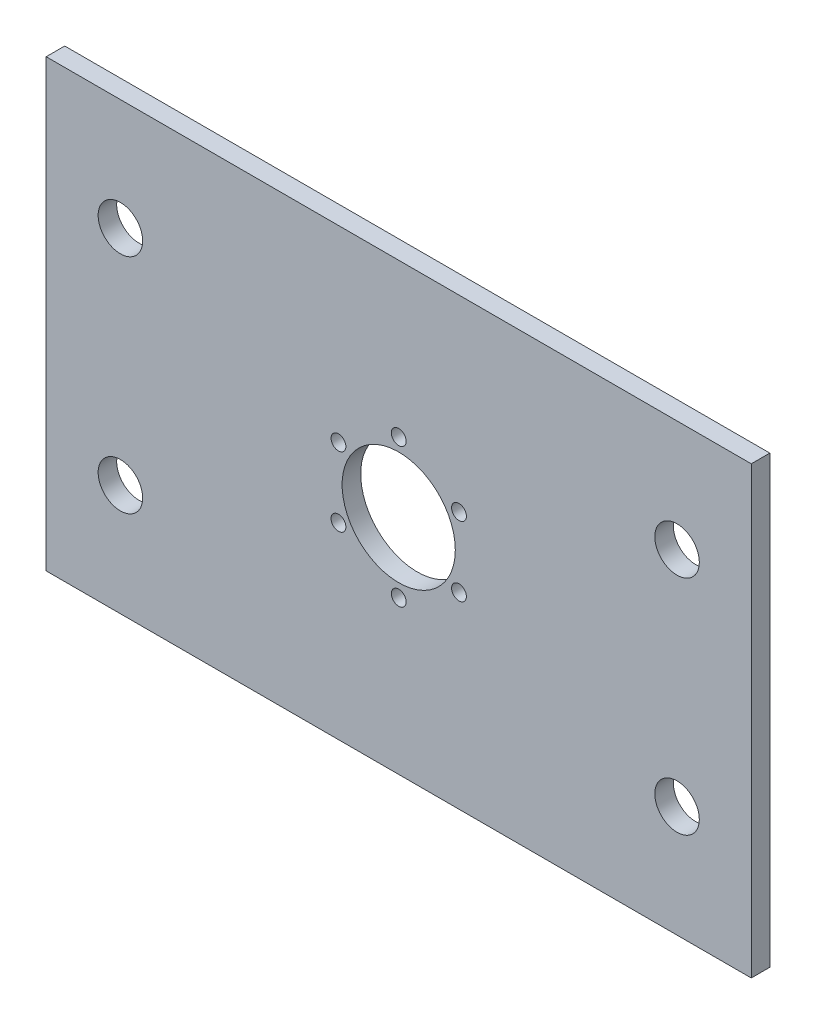
ISO-10303-21;
HEADER;
FILE_DESCRIPTION(('STEP AP214'),'2;1');
FILE_NAME('part.step','',(''),(''),'','','');
FILE_SCHEMA(('AUTOMOTIVE_DESIGN { 1 0 10303 214 1 1 1 1 }'));
ENDSEC;
DATA;
#1=APPLICATION_CONTEXT('core data for automotive mechanical design processes');
#2=APPLICATION_PROTOCOL_DEFINITION('international standard','automotive_design',2000,#1);
#3=PRODUCT_CONTEXT('',#1,'mechanical');
#4=PRODUCT('Part','Part','',(#3));
#5=PRODUCT_RELATED_PRODUCT_CATEGORY('part','',(#4));
#6=PRODUCT_DEFINITION_FORMATION('','',#4);
#7=PRODUCT_DEFINITION_CONTEXT('part definition',#1,'design');
#8=PRODUCT_DEFINITION('design','',#6,#7);
#9=PRODUCT_DEFINITION_SHAPE('','',#8);
#10=(LENGTH_UNIT() NAMED_UNIT(*) SI_UNIT(.MILLI.,.METRE.));
#11=(NAMED_UNIT(*) PLANE_ANGLE_UNIT() SI_UNIT($,.RADIAN.));
#12=(NAMED_UNIT(*) SI_UNIT($,.STERADIAN.) SOLID_ANGLE_UNIT());
#13=UNCERTAINTY_MEASURE_WITH_UNIT(LENGTH_MEASURE(1.E-05),#10,'distance_accuracy_value','');
#14=(GEOMETRIC_REPRESENTATION_CONTEXT(3) GLOBAL_UNCERTAINTY_ASSIGNED_CONTEXT((#13)) GLOBAL_UNIT_ASSIGNED_CONTEXT((#10,
#11,#12)) REPRESENTATION_CONTEXT('',''));
#15=CARTESIAN_POINT('',(0.,0.,0.));
#16=DIRECTION('',(0.,0.,1.));
#17=DIRECTION('',(1.,0.,0.));
#18=AXIS2_PLACEMENT_3D('',#15,#16,#17);
#19=CARTESIAN_POINT('',(0.,0.,5.));
#20=DIRECTION('',(0.,0.,1.));
#21=DIRECTION('',(1.,0.,0.));
#22=AXIS2_PLACEMENT_3D('',#19,#20,#21);
#23=PLANE('',#22);
#24=CARTESIAN_POINT('',(-16.2379763209583,-9.37499999999985,5.));
#25=DIRECTION('',(0.,0.,1.));
#26=DIRECTION('',(1.,0.,0.));
#27=AXIS2_PLACEMENT_3D('',#24,#25,#26);
#28=CIRCLE('',#27,2.);
#29=CARTESIAN_POINT('',(-14.2379763209583,-9.37499999999985,5.));
#30=VERTEX_POINT('',#29);
#31=EDGE_CURVE('E198',#30,#30,#28,.T.);
#32=ORIENTED_EDGE('',*,*,#31,.F.);
#33=EDGE_LOOP('',(#32));
#34=FACE_BOUND('',#33,.T.);
#35=CARTESIAN_POINT('',(16.2379763209582,-9.37500000000008,5.));
#36=DIRECTION('',(0.,0.,1.));
#37=DIRECTION('',(1.,0.,0.));
#38=AXIS2_PLACEMENT_3D('',#35,#36,#37);
#39=CIRCLE('',#38,2.);
#40=CARTESIAN_POINT('',(18.2379763209582,-9.37500000000008,5.));
#41=VERTEX_POINT('',#40);
#42=EDGE_CURVE('E182',#41,#41,#39,.T.);
#43=ORIENTED_EDGE('',*,*,#42,.F.);
#44=EDGE_LOOP('',(#43));
#45=FACE_BOUND('',#44,.T.);
#46=CARTESIAN_POINT('',(0.,18.75,5.));
#47=DIRECTION('',(0.,0.,1.));
#48=DIRECTION('',(1.,0.,0.));
#49=AXIS2_PLACEMENT_3D('',#46,#47,#48);
#50=CIRCLE('',#49,2.);
#51=CARTESIAN_POINT('',(2.,18.75,5.));
#52=VERTEX_POINT('',#51);
#53=EDGE_CURVE('E166',#52,#52,#50,.T.);
#54=ORIENTED_EDGE('',*,*,#53,.F.);
#55=EDGE_LOOP('',(#54));
#56=FACE_BOUND('',#55,.T.);
#57=CARTESIAN_POINT('',(-75.,-30.,5.));
#58=DIRECTION('',(0.,0.,1.));
#59=DIRECTION('',(1.,0.,0.));
#60=AXIS2_PLACEMENT_3D('',#57,#58,#59);
#61=CIRCLE('',#60,6.);
#62=CARTESIAN_POINT('',(-69.,-30.,5.));
#63=VERTEX_POINT('',#62);
#64=EDGE_CURVE('E150',#63,#63,#61,.T.);
#65=ORIENTED_EDGE('',*,*,#64,.F.);
#66=EDGE_LOOP('',(#65));
#67=FACE_BOUND('',#66,.T.);
#68=CARTESIAN_POINT('',(75.,30.,5.));
#69=DIRECTION('',(0.,0.,1.));
#70=DIRECTION('',(1.,0.,0.));
#71=AXIS2_PLACEMENT_3D('',#68,#69,#70);
#72=CIRCLE('',#71,6.);
#73=CARTESIAN_POINT('',(81.,30.,5.));
#74=VERTEX_POINT('',#73);
#75=EDGE_CURVE('E134',#74,#74,#72,.T.);
#76=ORIENTED_EDGE('',*,*,#75,.F.);
#77=EDGE_LOOP('',(#76));
#78=FACE_BOUND('',#77,.T.);
#79=DIRECTION('',(0.,1.,0.));
#80=VECTOR('',#79,1.);
#81=CARTESIAN_POINT('',(95.,60.,5.));
#82=LINE('',#81,#80);
#83=CARTESIAN_POINT('',(95.,-60.,5.));
#84=VERTEX_POINT('',#83);
#85=CARTESIAN_POINT('',(95.,60.,5.));
#86=VERTEX_POINT('',#85);
#87=EDGE_CURVE('E92',#84,#86,#82,.T.);
#88=ORIENTED_EDGE('',*,*,#87,.T.);
#89=DIRECTION('',(-1.,0.,0.));
#90=VECTOR('',#89,1.);
#91=CARTESIAN_POINT('',(-95.,60.0000000000001,5.));
#92=LINE('',#91,#90);
#93=CARTESIAN_POINT('',(-95.,60.0000000000001,5.));
#94=VERTEX_POINT('',#93);
#95=EDGE_CURVE('E87',#86,#94,#92,.T.);
#96=ORIENTED_EDGE('',*,*,#95,.T.);
#97=DIRECTION('',(0.,-1.,0.));
#98=VECTOR('',#97,1.);
#99=CARTESIAN_POINT('',(-95.,60.0000000000001,5.));
#100=LINE('',#99,#98);
#101=CARTESIAN_POINT('',(-95.,-60.,5.));
#102=VERTEX_POINT('',#101);
#103=EDGE_CURVE('E90',#94,#102,#100,.T.);
#104=ORIENTED_EDGE('',*,*,#103,.T.);
#105=DIRECTION('',(1.,0.,0.));
#106=VECTOR('',#105,1.);
#107=CARTESIAN_POINT('',(-95.,-60.,5.));
#108=LINE('',#107,#106);
#109=EDGE_CURVE('E57',#102,#84,#108,.T.);
#110=ORIENTED_EDGE('',*,*,#109,.T.);
#111=EDGE_LOOP('',(#88,#96,#104,#110));
#112=FACE_BOUND('',#111,.T.);
#113=CARTESIAN_POINT('',(-75.,30.,5.));
#114=DIRECTION('',(0.,0.,1.));
#115=DIRECTION('',(1.,0.,0.));
#116=AXIS2_PLACEMENT_3D('',#113,#114,#115);
#117=CIRCLE('',#116,6.);
#118=CARTESIAN_POINT('',(-69.,30.,5.));
#119=VERTEX_POINT('',#118);
#120=EDGE_CURVE('E112',#119,#119,#117,.T.);
#121=ORIENTED_EDGE('',*,*,#120,.F.);
#122=EDGE_LOOP('',(#121));
#123=FACE_BOUND('',#122,.T.);
#124=CARTESIAN_POINT('',(75.,-30.,5.));
#125=DIRECTION('',(0.,0.,1.));
#126=DIRECTION('',(1.,0.,0.));
#127=AXIS2_PLACEMENT_3D('',#124,#125,#126);
#128=CIRCLE('',#127,6.);
#129=CARTESIAN_POINT('',(81.,-30.,5.));
#130=VERTEX_POINT('',#129);
#131=EDGE_CURVE('E142',#130,#130,#128,.T.);
#132=ORIENTED_EDGE('',*,*,#131,.F.);
#133=EDGE_LOOP('',(#132));
#134=FACE_BOUND('',#133,.T.);
#135=CARTESIAN_POINT('',(0.,0.,5.));
#136=DIRECTION('',(0.,0.,1.));
#137=DIRECTION('',(1.,0.,0.));
#138=AXIS2_PLACEMENT_3D('',#135,#136,#137);
#139=CIRCLE('',#138,15.25);
#140=CARTESIAN_POINT('',(15.25,0.,5.));
#141=VERTEX_POINT('',#140);
#142=EDGE_CURVE('E158',#141,#141,#139,.T.);
#143=ORIENTED_EDGE('',*,*,#142,.F.);
#144=EDGE_LOOP('',(#143));
#145=FACE_BOUND('',#144,.T.);
#146=CARTESIAN_POINT('',(16.2379763209582,9.37499999999996,5.));
#147=DIRECTION('',(0.,0.,1.));
#148=DIRECTION('',(1.,0.,0.));
#149=AXIS2_PLACEMENT_3D('',#146,#147,#148);
#150=CIRCLE('',#149,2.);
#151=CARTESIAN_POINT('',(18.2379763209582,9.37499999999996,5.));
#152=VERTEX_POINT('',#151);
#153=EDGE_CURVE('E174',#152,#152,#150,.T.);
#154=ORIENTED_EDGE('',*,*,#153,.F.);
#155=EDGE_LOOP('',(#154));
#156=FACE_BOUND('',#155,.T.);
#157=CARTESIAN_POINT('',(-1.30930550206618E-13,-18.75,5.));
#158=DIRECTION('',(0.,0.,1.));
#159=DIRECTION('',(1.,0.,0.));
#160=AXIS2_PLACEMENT_3D('',#157,#158,#159);
#161=CIRCLE('',#160,2.);
#162=CARTESIAN_POINT('',(1.99999999999987,-18.75,5.));
#163=VERTEX_POINT('',#162);
#164=EDGE_CURVE('E190',#163,#163,#161,.T.);
#165=ORIENTED_EDGE('',*,*,#164,.F.);
#166=EDGE_LOOP('',(#165));
#167=FACE_BOUND('',#166,.T.);
#168=CARTESIAN_POINT('',(-16.2379763209581,9.37500000000019,5.));
#169=DIRECTION('',(0.,0.,1.));
#170=DIRECTION('',(1.,0.,0.));
#171=AXIS2_PLACEMENT_3D('',#168,#169,#170);
#172=CIRCLE('',#171,2.);
#173=CARTESIAN_POINT('',(-14.2379763209581,9.37500000000019,5.));
#174=VERTEX_POINT('',#173);
#175=EDGE_CURVE('E206',#174,#174,#172,.T.);
#176=ORIENTED_EDGE('',*,*,#175,.F.);
#177=EDGE_LOOP('',(#176));
#178=FACE_BOUND('',#177,.T.);
#179=ADVANCED_FACE('F39',(#34,#45,#56,#67,#78,#112,#123,#134,#145,#156,#167,#178),#23,.T.);
#180=CARTESIAN_POINT('',(0.,0.,0.));
#181=DIRECTION('',(0.,0.,1.));
#182=DIRECTION('',(1.,0.,0.));
#183=AXIS2_PLACEMENT_3D('',#180,#181,#182);
#184=PLANE('',#183);
#185=DIRECTION('',(0.,1.,0.));
#186=VECTOR('',#185,1.);
#187=CARTESIAN_POINT('',(95.,60.,0.));
#188=LINE('',#187,#186);
#189=CARTESIAN_POINT('',(95.,-60.,0.));
#190=VERTEX_POINT('',#189);
#191=CARTESIAN_POINT('',(95.,60.,0.));
#192=VERTEX_POINT('',#191);
#193=EDGE_CURVE('E108',#190,#192,#188,.T.);
#194=ORIENTED_EDGE('',*,*,#193,.F.);
#195=DIRECTION('',(1.,0.,0.));
#196=VECTOR('',#195,1.);
#197=CARTESIAN_POINT('',(-95.,-60.,0.));
#198=LINE('',#197,#196);
#199=CARTESIAN_POINT('',(-95.,-60.,0.));
#200=VERTEX_POINT('',#199);
#201=EDGE_CURVE('E80',#200,#190,#198,.T.);
#202=ORIENTED_EDGE('',*,*,#201,.F.);
#203=DIRECTION('',(0.,-1.,0.));
#204=VECTOR('',#203,1.);
#205=CARTESIAN_POINT('',(-95.,60.0000000000001,0.));
#206=LINE('',#205,#204);
#207=CARTESIAN_POINT('',(-95.,60.0000000000001,0.));
#208=VERTEX_POINT('',#207);
#209=EDGE_CURVE('E74',#208,#200,#206,.T.);
#210=ORIENTED_EDGE('',*,*,#209,.F.);
#211=DIRECTION('',(-1.,0.,0.));
#212=VECTOR('',#211,1.);
#213=CARTESIAN_POINT('',(-95.,60.0000000000001,0.));
#214=LINE('',#213,#212);
#215=EDGE_CURVE('E97',#192,#208,#214,.T.);
#216=ORIENTED_EDGE('',*,*,#215,.F.);
#217=EDGE_LOOP('',(#194,#202,#210,#216));
#218=FACE_BOUND('',#217,.T.);
#219=CARTESIAN_POINT('',(-75.,30.,0.));
#220=DIRECTION('',(0.,0.,1.));
#221=DIRECTION('',(1.,0.,0.));
#222=AXIS2_PLACEMENT_3D('',#219,#220,#221);
#223=CIRCLE('',#222,6.);
#224=CARTESIAN_POINT('',(-69.,30.,0.));
#225=VERTEX_POINT('',#224);
#226=EDGE_CURVE('E130',#225,#225,#223,.T.);
#227=ORIENTED_EDGE('',*,*,#226,.T.);
#228=EDGE_LOOP('',(#227));
#229=FACE_BOUND('',#228,.T.);
#230=CARTESIAN_POINT('',(75.,30.,0.));
#231=DIRECTION('',(0.,0.,1.));
#232=DIRECTION('',(1.,0.,0.));
#233=AXIS2_PLACEMENT_3D('',#230,#231,#232);
#234=CIRCLE('',#233,6.);
#235=CARTESIAN_POINT('',(81.,30.,0.));
#236=VERTEX_POINT('',#235);
#237=EDGE_CURVE('E138',#236,#236,#234,.T.);
#238=ORIENTED_EDGE('',*,*,#237,.T.);
#239=EDGE_LOOP('',(#238));
#240=FACE_BOUND('',#239,.T.);
#241=CARTESIAN_POINT('',(75.,-30.,0.));
#242=DIRECTION('',(0.,0.,1.));
#243=DIRECTION('',(1.,0.,0.));
#244=AXIS2_PLACEMENT_3D('',#241,#242,#243);
#245=CIRCLE('',#244,6.);
#246=CARTESIAN_POINT('',(81.,-30.,0.));
#247=VERTEX_POINT('',#246);
#248=EDGE_CURVE('E146',#247,#247,#245,.T.);
#249=ORIENTED_EDGE('',*,*,#248,.T.);
#250=EDGE_LOOP('',(#249));
#251=FACE_BOUND('',#250,.T.);
#252=CARTESIAN_POINT('',(-75.,-30.,0.));
#253=DIRECTION('',(0.,0.,1.));
#254=DIRECTION('',(1.,0.,0.));
#255=AXIS2_PLACEMENT_3D('',#252,#253,#254);
#256=CIRCLE('',#255,6.);
#257=CARTESIAN_POINT('',(-69.,-30.,0.));
#258=VERTEX_POINT('',#257);
#259=EDGE_CURVE('E154',#258,#258,#256,.T.);
#260=ORIENTED_EDGE('',*,*,#259,.T.);
#261=EDGE_LOOP('',(#260));
#262=FACE_BOUND('',#261,.T.);
#263=CARTESIAN_POINT('',(0.,0.,0.));
#264=DIRECTION('',(0.,0.,1.));
#265=DIRECTION('',(1.,0.,0.));
#266=AXIS2_PLACEMENT_3D('',#263,#264,#265);
#267=CIRCLE('',#266,15.25);
#268=CARTESIAN_POINT('',(15.25,0.,0.));
#269=VERTEX_POINT('',#268);
#270=EDGE_CURVE('E162',#269,#269,#267,.T.);
#271=ORIENTED_EDGE('',*,*,#270,.T.);
#272=EDGE_LOOP('',(#271));
#273=FACE_BOUND('',#272,.T.);
#274=CARTESIAN_POINT('',(0.,18.75,0.));
#275=DIRECTION('',(0.,0.,1.));
#276=DIRECTION('',(1.,0.,0.));
#277=AXIS2_PLACEMENT_3D('',#274,#275,#276);
#278=CIRCLE('',#277,2.);
#279=CARTESIAN_POINT('',(2.,18.75,0.));
#280=VERTEX_POINT('',#279);
#281=EDGE_CURVE('E170',#280,#280,#278,.T.);
#282=ORIENTED_EDGE('',*,*,#281,.T.);
#283=EDGE_LOOP('',(#282));
#284=FACE_BOUND('',#283,.T.);
#285=CARTESIAN_POINT('',(16.2379763209582,9.37499999999996,0.));
#286=DIRECTION('',(0.,0.,1.));
#287=DIRECTION('',(1.,0.,0.));
#288=AXIS2_PLACEMENT_3D('',#285,#286,#287);
#289=CIRCLE('',#288,2.);
#290=CARTESIAN_POINT('',(18.2379763209582,9.37499999999996,0.));
#291=VERTEX_POINT('',#290);
#292=EDGE_CURVE('E178',#291,#291,#289,.T.);
#293=ORIENTED_EDGE('',*,*,#292,.T.);
#294=EDGE_LOOP('',(#293));
#295=FACE_BOUND('',#294,.T.);
#296=CARTESIAN_POINT('',(16.2379763209582,-9.37500000000008,0.));
#297=DIRECTION('',(0.,0.,1.));
#298=DIRECTION('',(1.,0.,0.));
#299=AXIS2_PLACEMENT_3D('',#296,#297,#298);
#300=CIRCLE('',#299,2.);
#301=CARTESIAN_POINT('',(18.2379763209582,-9.37500000000008,0.));
#302=VERTEX_POINT('',#301);
#303=EDGE_CURVE('E186',#302,#302,#300,.T.);
#304=ORIENTED_EDGE('',*,*,#303,.T.);
#305=EDGE_LOOP('',(#304));
#306=FACE_BOUND('',#305,.T.);
#307=CARTESIAN_POINT('',(-1.30930550206618E-13,-18.75,0.));
#308=DIRECTION('',(0.,0.,1.));
#309=DIRECTION('',(1.,0.,0.));
#310=AXIS2_PLACEMENT_3D('',#307,#308,#309);
#311=CIRCLE('',#310,2.);
#312=CARTESIAN_POINT('',(1.99999999999987,-18.75,0.));
#313=VERTEX_POINT('',#312);
#314=EDGE_CURVE('E194',#313,#313,#311,.T.);
#315=ORIENTED_EDGE('',*,*,#314,.T.);
#316=EDGE_LOOP('',(#315));
#317=FACE_BOUND('',#316,.T.);
#318=CARTESIAN_POINT('',(-16.2379763209583,-9.37499999999985,0.));
#319=DIRECTION('',(0.,0.,1.));
#320=DIRECTION('',(1.,0.,0.));
#321=AXIS2_PLACEMENT_3D('',#318,#319,#320);
#322=CIRCLE('',#321,2.);
#323=CARTESIAN_POINT('',(-14.2379763209583,-9.37499999999985,0.));
#324=VERTEX_POINT('',#323);
#325=EDGE_CURVE('E202',#324,#324,#322,.T.);
#326=ORIENTED_EDGE('',*,*,#325,.T.);
#327=EDGE_LOOP('',(#326));
#328=FACE_BOUND('',#327,.T.);
#329=CARTESIAN_POINT('',(-16.2379763209581,9.37500000000019,0.));
#330=DIRECTION('',(0.,0.,1.));
#331=DIRECTION('',(1.,0.,0.));
#332=AXIS2_PLACEMENT_3D('',#329,#330,#331);
#333=CIRCLE('',#332,2.);
#334=CARTESIAN_POINT('',(-14.2379763209581,9.37500000000019,0.));
#335=VERTEX_POINT('',#334);
#336=EDGE_CURVE('E210',#335,#335,#333,.T.);
#337=ORIENTED_EDGE('',*,*,#336,.T.);
#338=EDGE_LOOP('',(#337));
#339=FACE_BOUND('',#338,.T.);
#340=ADVANCED_FACE('F125',(#218,#229,#240,#251,#262,#273,#284,#295,#306,#317,#328,#339),#184,.F.);
#341=CARTESIAN_POINT('',(95.,60.,5.));
#342=DIRECTION('',(-1.,0.,0.));
#343=DIRECTION('',(0.,-1.,0.));
#344=AXIS2_PLACEMENT_3D('',#341,#342,#343);
#345=PLANE('',#344);
#346=ORIENTED_EDGE('',*,*,#193,.T.);
#347=DIRECTION('',(0.,0.,-1.));
#348=VECTOR('',#347,1.);
#349=CARTESIAN_POINT('',(95.,60.,5.));
#350=LINE('',#349,#348);
#351=EDGE_CURVE('E11',#86,#192,#350,.T.);
#352=ORIENTED_EDGE('',*,*,#351,.F.);
#353=ORIENTED_EDGE('',*,*,#87,.F.);
#354=DIRECTION('',(0.,0.,-1.));
#355=VECTOR('',#354,1.);
#356=CARTESIAN_POINT('',(95.,-60.,5.));
#357=LINE('',#356,#355);
#358=EDGE_CURVE('E104',#84,#190,#357,.T.);
#359=ORIENTED_EDGE('',*,*,#358,.T.);
#360=EDGE_LOOP('',(#346,#352,#353,#359));
#361=FACE_BOUND('',#360,.T.);
#362=ADVANCED_FACE('F41',(#361),#345,.F.);
#363=CARTESIAN_POINT('',(-95.,60.0000000000001,5.));
#364=DIRECTION('',(0.,-1.,0.));
#365=DIRECTION('',(1.,0.,0.));
#366=AXIS2_PLACEMENT_3D('',#363,#364,#365);
#367=PLANE('',#366);
#368=ORIENTED_EDGE('',*,*,#215,.T.);
#369=DIRECTION('',(0.,0.,-1.));
#370=VECTOR('',#369,1.);
#371=CARTESIAN_POINT('',(-95.,60.0000000000001,5.));
#372=LINE('',#371,#370);
#373=EDGE_CURVE('E49',#94,#208,#372,.T.);
#374=ORIENTED_EDGE('',*,*,#373,.F.);
#375=ORIENTED_EDGE('',*,*,#95,.F.);
#376=ORIENTED_EDGE('',*,*,#351,.T.);
#377=EDGE_LOOP('',(#368,#374,#375,#376));
#378=FACE_BOUND('',#377,.T.);
#379=ADVANCED_FACE('F96',(#378),#367,.F.);
#380=CARTESIAN_POINT('',(-95.,60.0000000000001,5.));
#381=DIRECTION('',(1.,0.,0.));
#382=DIRECTION('',(0.,0.,-1.));
#383=AXIS2_PLACEMENT_3D('',#380,#381,#382);
#384=PLANE('',#383);
#385=ORIENTED_EDGE('',*,*,#209,.T.);
#386=DIRECTION('',(0.,0.,-1.));
#387=VECTOR('',#386,1.);
#388=CARTESIAN_POINT('',(-95.,-60.,5.));
#389=LINE('',#388,#387);
#390=EDGE_CURVE('E99',#102,#200,#389,.T.);
#391=ORIENTED_EDGE('',*,*,#390,.F.);
#392=ORIENTED_EDGE('',*,*,#103,.F.);
#393=ORIENTED_EDGE('',*,*,#373,.T.);
#394=EDGE_LOOP('',(#385,#391,#392,#393));
#395=FACE_BOUND('',#394,.T.);
#396=ADVANCED_FACE('F100',(#395),#384,.F.);
#397=CARTESIAN_POINT('',(-95.,-60.,5.));
#398=DIRECTION('',(0.,1.,0.));
#399=DIRECTION('',(0.,0.,1.));
#400=AXIS2_PLACEMENT_3D('',#397,#398,#399);
#401=PLANE('',#400);
#402=ORIENTED_EDGE('',*,*,#201,.T.);
#403=ORIENTED_EDGE('',*,*,#358,.F.);
#404=ORIENTED_EDGE('',*,*,#109,.F.);
#405=ORIENTED_EDGE('',*,*,#390,.T.);
#406=EDGE_LOOP('',(#402,#403,#404,#405));
#407=FACE_BOUND('',#406,.T.);
#408=ADVANCED_FACE('F122',(#407),#401,.F.);
#409=CARTESIAN_POINT('',(-75.,30.,5.));
#410=DIRECTION('',(0.,0.,-1.));
#411=DIRECTION('',(-1.,0.,0.));
#412=AXIS2_PLACEMENT_3D('',#409,#410,#411);
#413=CYLINDRICAL_SURFACE('',#412,6.);
#414=ORIENTED_EDGE('',*,*,#120,.T.);
#415=EDGE_LOOP('',(#414));
#416=FACE_BOUND('',#415,.T.);
#417=ORIENTED_EDGE('',*,*,#226,.F.);
#418=EDGE_LOOP('',(#417));
#419=FACE_BOUND('',#418,.T.);
#420=ADVANCED_FACE('F231',(#416,#419),#413,.F.);
#421=CARTESIAN_POINT('',(75.,30.,5.));
#422=DIRECTION('',(0.,0.,-1.));
#423=DIRECTION('',(-1.,0.,0.));
#424=AXIS2_PLACEMENT_3D('',#421,#422,#423);
#425=CYLINDRICAL_SURFACE('',#424,6.);
#426=ORIENTED_EDGE('',*,*,#75,.T.);
#427=EDGE_LOOP('',(#426));
#428=FACE_BOUND('',#427,.T.);
#429=ORIENTED_EDGE('',*,*,#237,.F.);
#430=EDGE_LOOP('',(#429));
#431=FACE_BOUND('',#430,.T.);
#432=ADVANCED_FACE('F277',(#428,#431),#425,.F.);
#433=CARTESIAN_POINT('',(75.,-30.,5.));
#434=DIRECTION('',(0.,0.,-1.));
#435=DIRECTION('',(-1.,0.,0.));
#436=AXIS2_PLACEMENT_3D('',#433,#434,#435);
#437=CYLINDRICAL_SURFACE('',#436,6.);
#438=ORIENTED_EDGE('',*,*,#131,.T.);
#439=EDGE_LOOP('',(#438));
#440=FACE_BOUND('',#439,.T.);
#441=ORIENTED_EDGE('',*,*,#248,.F.);
#442=EDGE_LOOP('',(#441));
#443=FACE_BOUND('',#442,.T.);
#444=ADVANCED_FACE('F285',(#440,#443),#437,.F.);
#445=CARTESIAN_POINT('',(-75.,-30.,5.));
#446=DIRECTION('',(0.,0.,-1.));
#447=DIRECTION('',(-1.,0.,0.));
#448=AXIS2_PLACEMENT_3D('',#445,#446,#447);
#449=CYLINDRICAL_SURFACE('',#448,6.);
#450=ORIENTED_EDGE('',*,*,#64,.T.);
#451=EDGE_LOOP('',(#450));
#452=FACE_BOUND('',#451,.T.);
#453=ORIENTED_EDGE('',*,*,#259,.F.);
#454=EDGE_LOOP('',(#453));
#455=FACE_BOUND('',#454,.T.);
#456=ADVANCED_FACE('F293',(#452,#455),#449,.F.);
#457=CARTESIAN_POINT('',(0.,0.,5.));
#458=DIRECTION('',(0.,0.,-1.));
#459=DIRECTION('',(-1.,0.,0.));
#460=AXIS2_PLACEMENT_3D('',#457,#458,#459);
#461=CYLINDRICAL_SURFACE('',#460,15.25);
#462=ORIENTED_EDGE('',*,*,#142,.T.);
#463=EDGE_LOOP('',(#462));
#464=FACE_BOUND('',#463,.T.);
#465=ORIENTED_EDGE('',*,*,#270,.F.);
#466=EDGE_LOOP('',(#465));
#467=FACE_BOUND('',#466,.T.);
#468=ADVANCED_FACE('F302',(#464,#467),#461,.F.);
#469=CARTESIAN_POINT('',(0.,18.75,5.));
#470=DIRECTION('',(0.,0.,-1.));
#471=DIRECTION('',(-1.,0.,0.));
#472=AXIS2_PLACEMENT_3D('',#469,#470,#471);
#473=CYLINDRICAL_SURFACE('',#472,2.);
#474=ORIENTED_EDGE('',*,*,#53,.T.);
#475=EDGE_LOOP('',(#474));
#476=FACE_BOUND('',#475,.T.);
#477=ORIENTED_EDGE('',*,*,#281,.F.);
#478=EDGE_LOOP('',(#477));
#479=FACE_BOUND('',#478,.T.);
#480=ADVANCED_FACE('F311',(#476,#479),#473,.F.);
#481=CARTESIAN_POINT('',(16.2379763209582,9.37499999999996,5.));
#482=DIRECTION('',(0.,0.,-1.));
#483=DIRECTION('',(-1.,0.,0.));
#484=AXIS2_PLACEMENT_3D('',#481,#482,#483);
#485=CYLINDRICAL_SURFACE('',#484,2.);
#486=ORIENTED_EDGE('',*,*,#153,.T.);
#487=EDGE_LOOP('',(#486));
#488=FACE_BOUND('',#487,.T.);
#489=ORIENTED_EDGE('',*,*,#292,.F.);
#490=EDGE_LOOP('',(#489));
#491=FACE_BOUND('',#490,.T.);
#492=ADVANCED_FACE('F320',(#488,#491),#485,.F.);
#493=CARTESIAN_POINT('',(16.2379763209582,-9.37500000000008,5.));
#494=DIRECTION('',(0.,0.,-1.));
#495=DIRECTION('',(-1.,0.,0.));
#496=AXIS2_PLACEMENT_3D('',#493,#494,#495);
#497=CYLINDRICAL_SURFACE('',#496,2.);
#498=ORIENTED_EDGE('',*,*,#42,.T.);
#499=EDGE_LOOP('',(#498));
#500=FACE_BOUND('',#499,.T.);
#501=ORIENTED_EDGE('',*,*,#303,.F.);
#502=EDGE_LOOP('',(#501));
#503=FACE_BOUND('',#502,.T.);
#504=ADVANCED_FACE('F329',(#500,#503),#497,.F.);
#505=CARTESIAN_POINT('',(-1.30930550206618E-13,-18.75,5.));
#506=DIRECTION('',(0.,0.,-1.));
#507=DIRECTION('',(-1.,0.,0.));
#508=AXIS2_PLACEMENT_3D('',#505,#506,#507);
#509=CYLINDRICAL_SURFACE('',#508,2.);
#510=ORIENTED_EDGE('',*,*,#164,.T.);
#511=EDGE_LOOP('',(#510));
#512=FACE_BOUND('',#511,.T.);
#513=ORIENTED_EDGE('',*,*,#314,.F.);
#514=EDGE_LOOP('',(#513));
#515=FACE_BOUND('',#514,.T.);
#516=ADVANCED_FACE('F338',(#512,#515),#509,.F.);
#517=CARTESIAN_POINT('',(-16.2379763209583,-9.37499999999985,5.));
#518=DIRECTION('',(0.,0.,-1.));
#519=DIRECTION('',(-1.,0.,0.));
#520=AXIS2_PLACEMENT_3D('',#517,#518,#519);
#521=CYLINDRICAL_SURFACE('',#520,2.);
#522=ORIENTED_EDGE('',*,*,#31,.T.);
#523=EDGE_LOOP('',(#522));
#524=FACE_BOUND('',#523,.T.);
#525=ORIENTED_EDGE('',*,*,#325,.F.);
#526=EDGE_LOOP('',(#525));
#527=FACE_BOUND('',#526,.T.);
#528=ADVANCED_FACE('F347',(#524,#527),#521,.F.);
#529=CARTESIAN_POINT('',(-16.2379763209581,9.37500000000019,5.));
#530=DIRECTION('',(0.,0.,-1.));
#531=DIRECTION('',(-1.,0.,0.));
#532=AXIS2_PLACEMENT_3D('',#529,#530,#531);
#533=CYLINDRICAL_SURFACE('',#532,2.);
#534=ORIENTED_EDGE('',*,*,#175,.T.);
#535=EDGE_LOOP('',(#534));
#536=FACE_BOUND('',#535,.T.);
#537=ORIENTED_EDGE('',*,*,#336,.F.);
#538=EDGE_LOOP('',(#537));
#539=FACE_BOUND('',#538,.T.);
#540=ADVANCED_FACE('F218',(#536,#539),#533,.F.);
#541=CLOSED_SHELL('',(#179,#340,#362,#379,#396,#408,#420,#432,#444,#456,#468,#480,#492,#504,
#516,#528,#540));
#542=MANIFOLD_SOLID_BREP('B2',#541);
#543=ADVANCED_BREP_SHAPE_REPRESENTATION('',(#18,#542),#14);
#544=SHAPE_DEFINITION_REPRESENTATION(#9,#543);
ENDSEC;
END-ISO-10303-21;
